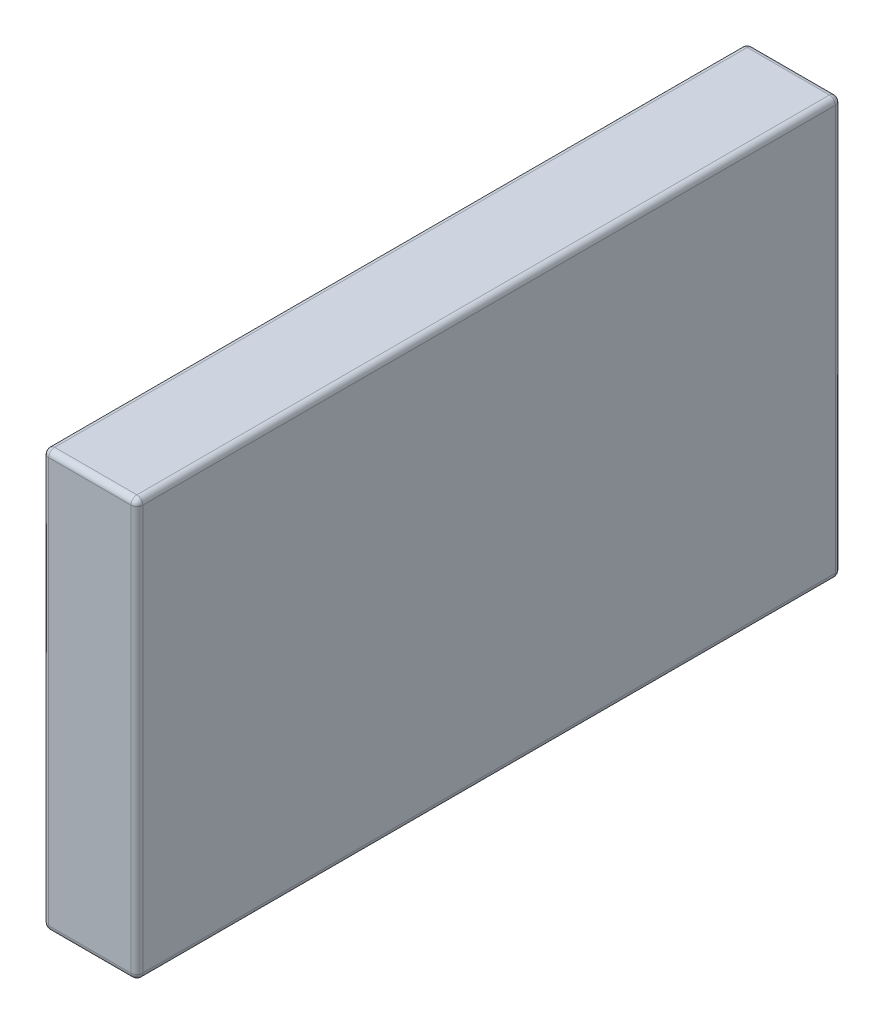
ISO-10303-21;
HEADER;
FILE_DESCRIPTION(('STEP AP214'),'2;1');
FILE_NAME('part.step','',(''),(''),'','','');
FILE_SCHEMA(('AUTOMOTIVE_DESIGN { 1 0 10303 214 1 1 1 1 }'));
ENDSEC;
DATA;
#1=APPLICATION_CONTEXT('core data for automotive mechanical design processes');
#2=APPLICATION_PROTOCOL_DEFINITION('international standard','automotive_design',2000,#1);
#3=PRODUCT_CONTEXT('',#1,'mechanical');
#4=PRODUCT('Part','Part','',(#3));
#5=PRODUCT_RELATED_PRODUCT_CATEGORY('part','',(#4));
#6=PRODUCT_DEFINITION_FORMATION('','',#4);
#7=PRODUCT_DEFINITION_CONTEXT('part definition',#1,'design');
#8=PRODUCT_DEFINITION('design','',#6,#7);
#9=PRODUCT_DEFINITION_SHAPE('','',#8);
#10=(LENGTH_UNIT() NAMED_UNIT(*) SI_UNIT(.MILLI.,.METRE.));
#11=(NAMED_UNIT(*) PLANE_ANGLE_UNIT() SI_UNIT($,.RADIAN.));
#12=(NAMED_UNIT(*) SI_UNIT($,.STERADIAN.) SOLID_ANGLE_UNIT());
#13=UNCERTAINTY_MEASURE_WITH_UNIT(LENGTH_MEASURE(1.E-05),#10,'distance_accuracy_value','');
#14=(GEOMETRIC_REPRESENTATION_CONTEXT(3) GLOBAL_UNCERTAINTY_ASSIGNED_CONTEXT((#13)) GLOBAL_UNIT_ASSIGNED_CONTEXT((#10,
#11,#12)) REPRESENTATION_CONTEXT('',''));
#15=CARTESIAN_POINT('',(0.,0.,0.));
#16=DIRECTION('',(0.,0.,1.));
#17=DIRECTION('',(1.,0.,0.));
#18=AXIS2_PLACEMENT_3D('',#15,#16,#17);
#19=CARTESIAN_POINT('',(-10.033,44.45,75.057));
#20=DIRECTION('',(1.,0.,0.));
#21=DIRECTION('',(0.,0.,-1.));
#22=AXIS2_PLACEMENT_3D('',#19,#20,#21);
#23=PLANE('',#22);
#24=DIRECTION('',(0.,0.,1.));
#25=VECTOR('',#24,1.);
#26=CARTESIAN_POINT('',(-10.033,43.18,-75.057));
#27=LINE('',#26,#25);
#28=CARTESIAN_POINT('',(-10.033,43.18,73.787));
#29=VERTEX_POINT('',#28);
#30=CARTESIAN_POINT('',(-10.033,43.18,-73.787));
#31=VERTEX_POINT('',#30);
#32=EDGE_CURVE('E173',#29,#31,#27,.F.);
#33=ORIENTED_EDGE('',*,*,#32,.T.);
#34=DIRECTION('',(0.,-1.,0.));
#35=VECTOR('',#34,1.);
#36=CARTESIAN_POINT('',(-10.033,44.45,-73.787));
#37=LINE('',#36,#35);
#38=CARTESIAN_POINT('',(-10.033,-43.18,-73.787));
#39=VERTEX_POINT('',#38);
#40=EDGE_CURVE('E179',#31,#39,#37,.T.);
#41=ORIENTED_EDGE('',*,*,#40,.T.);
#42=DIRECTION('',(0.,0.,1.));
#43=VECTOR('',#42,1.);
#44=CARTESIAN_POINT('',(-10.033,-43.18,75.057));
#45=LINE('',#44,#43);
#46=CARTESIAN_POINT('',(-10.033,-43.18,73.787));
#47=VERTEX_POINT('',#46);
#48=EDGE_CURVE('E177',#39,#47,#45,.T.);
#49=ORIENTED_EDGE('',*,*,#48,.T.);
#50=DIRECTION('',(0.,-1.,0.));
#51=VECTOR('',#50,1.);
#52=CARTESIAN_POINT('',(-10.033,44.45,73.787));
#53=LINE('',#52,#51);
#54=EDGE_CURVE('E175',#47,#29,#53,.F.);
#55=ORIENTED_EDGE('',*,*,#54,.T.);
#56=EDGE_LOOP('',(#33,#41,#49,#55));
#57=FACE_BOUND('',#56,.T.);
#58=ADVANCED_FACE('F33',(#57),#23,.F.);
#59=CARTESIAN_POINT('',(10.033,44.45,75.057));
#60=DIRECTION('',(0.,0.,-1.));
#61=DIRECTION('',(-1.,0.,0.));
#62=AXIS2_PLACEMENT_3D('',#59,#60,#61);
#63=PLANE('',#62);
#64=DIRECTION('',(1.,0.,0.));
#65=VECTOR('',#64,1.);
#66=CARTESIAN_POINT('',(-10.033,43.18,75.057));
#67=LINE('',#66,#65);
#68=CARTESIAN_POINT('',(8.76299999999999,43.18,75.057));
#69=VERTEX_POINT('',#68);
#70=CARTESIAN_POINT('',(-8.76300000000001,43.18,75.057));
#71=VERTEX_POINT('',#70);
#72=EDGE_CURVE('E184',#69,#71,#67,.F.);
#73=ORIENTED_EDGE('',*,*,#72,.T.);
#74=DIRECTION('',(0.,-1.,0.));
#75=VECTOR('',#74,1.);
#76=CARTESIAN_POINT('',(-8.76300000000001,44.45,75.057));
#77=LINE('',#76,#75);
#78=CARTESIAN_POINT('',(-8.76300000000001,-43.18,75.057));
#79=VERTEX_POINT('',#78);
#80=EDGE_CURVE('E188',#71,#79,#77,.T.);
#81=ORIENTED_EDGE('',*,*,#80,.T.);
#82=DIRECTION('',(1.,0.,0.));
#83=VECTOR('',#82,1.);
#84=CARTESIAN_POINT('',(10.033,-43.18,75.057));
#85=LINE('',#84,#83);
#86=CARTESIAN_POINT('',(8.76299999999999,-43.18,75.057));
#87=VERTEX_POINT('',#86);
#88=EDGE_CURVE('E186',#79,#87,#85,.T.);
#89=ORIENTED_EDGE('',*,*,#88,.T.);
#90=DIRECTION('',(0.,-1.,0.));
#91=VECTOR('',#90,1.);
#92=CARTESIAN_POINT('',(8.76299999999999,44.45,75.057));
#93=LINE('',#92,#91);
#94=EDGE_CURVE('E182',#87,#69,#93,.F.);
#95=ORIENTED_EDGE('',*,*,#94,.T.);
#96=EDGE_LOOP('',(#73,#81,#89,#95));
#97=FACE_BOUND('',#96,.T.);
#98=ADVANCED_FACE('F272',(#97),#63,.F.);
#99=CARTESIAN_POINT('',(10.033,44.45,75.057));
#100=DIRECTION('',(-1.,0.,0.));
#101=DIRECTION('',(0.,0.,1.));
#102=AXIS2_PLACEMENT_3D('',#99,#100,#101);
#103=PLANE('',#102);
#104=DIRECTION('',(0.,0.,-1.));
#105=VECTOR('',#104,1.);
#106=CARTESIAN_POINT('',(10.033,43.18,75.057));
#107=LINE('',#106,#105);
#108=CARTESIAN_POINT('',(10.033,43.18,-73.787));
#109=VERTEX_POINT('',#108);
#110=CARTESIAN_POINT('',(10.033,43.18,73.787));
#111=VERTEX_POINT('',#110);
#112=EDGE_CURVE('E42',#109,#111,#107,.F.);
#113=ORIENTED_EDGE('',*,*,#112,.T.);
#114=DIRECTION('',(0.,-1.,0.));
#115=VECTOR('',#114,1.);
#116=CARTESIAN_POINT('',(10.033,44.45,73.787));
#117=LINE('',#116,#115);
#118=CARTESIAN_POINT('',(10.033,-43.18,73.787));
#119=VERTEX_POINT('',#118);
#120=EDGE_CURVE('E11',#111,#119,#117,.T.);
#121=ORIENTED_EDGE('',*,*,#120,.T.);
#122=DIRECTION('',(0.,0.,-1.));
#123=VECTOR('',#122,1.);
#124=CARTESIAN_POINT('',(10.033,-43.18,75.057));
#125=LINE('',#124,#123);
#126=CARTESIAN_POINT('',(10.033,-43.18,-73.787));
#127=VERTEX_POINT('',#126);
#128=EDGE_CURVE('E198',#119,#127,#125,.T.);
#129=ORIENTED_EDGE('',*,*,#128,.T.);
#130=DIRECTION('',(0.,-1.,0.));
#131=VECTOR('',#130,1.);
#132=CARTESIAN_POINT('',(10.033,44.45,-73.787));
#133=LINE('',#132,#131);
#134=EDGE_CURVE('E53',#127,#109,#133,.F.);
#135=ORIENTED_EDGE('',*,*,#134,.T.);
#136=EDGE_LOOP('',(#113,#121,#129,#135));
#137=FACE_BOUND('',#136,.T.);
#138=ADVANCED_FACE('F285',(#137),#103,.F.);
#139=CARTESIAN_POINT('',(10.033,44.45,-75.057));
#140=DIRECTION('',(0.,0.,1.));
#141=DIRECTION('',(1.,0.,0.));
#142=AXIS2_PLACEMENT_3D('',#139,#140,#141);
#143=PLANE('',#142);
#144=DIRECTION('',(0.,-1.,0.));
#145=VECTOR('',#144,1.);
#146=CARTESIAN_POINT('',(8.76299999999999,44.45,-75.057));
#147=LINE('',#146,#145);
#148=CARTESIAN_POINT('',(8.76299999999999,43.18,-75.057));
#149=VERTEX_POINT('',#148);
#150=CARTESIAN_POINT('',(8.76299999999999,-43.18,-75.057));
#151=VERTEX_POINT('',#150);
#152=EDGE_CURVE('E125',#149,#151,#147,.T.);
#153=ORIENTED_EDGE('',*,*,#152,.T.);
#154=DIRECTION('',(-1.,0.,0.));
#155=VECTOR('',#154,1.);
#156=CARTESIAN_POINT('',(10.033,-43.18,-75.057));
#157=LINE('',#156,#155);
#158=CARTESIAN_POINT('',(-8.76300000000001,-43.18,-75.057));
#159=VERTEX_POINT('',#158);
#160=EDGE_CURVE('E162',#151,#159,#157,.T.);
#161=ORIENTED_EDGE('',*,*,#160,.T.);
#162=DIRECTION('',(0.,-1.,0.));
#163=VECTOR('',#162,1.);
#164=CARTESIAN_POINT('',(-8.76300000000001,44.45,-75.057));
#165=LINE('',#164,#163);
#166=CARTESIAN_POINT('',(-8.76300000000001,43.18,-75.057));
#167=VERTEX_POINT('',#166);
#168=EDGE_CURVE('E128',#159,#167,#165,.F.);
#169=ORIENTED_EDGE('',*,*,#168,.T.);
#170=DIRECTION('',(-1.,0.,0.));
#171=VECTOR('',#170,1.);
#172=CARTESIAN_POINT('',(10.033,43.18,-75.057));
#173=LINE('',#172,#171);
#174=EDGE_CURVE('E120',#167,#149,#173,.F.);
#175=ORIENTED_EDGE('',*,*,#174,.T.);
#176=EDGE_LOOP('',(#153,#161,#169,#175));
#177=FACE_BOUND('',#176,.T.);
#178=ADVANCED_FACE('F122',(#177),#143,.F.);
#179=CARTESIAN_POINT('',(0.,44.45,0.));
#180=DIRECTION('',(0.,1.,0.));
#181=DIRECTION('',(0.,0.,1.));
#182=AXIS2_PLACEMENT_3D('',#179,#180,#181);
#183=PLANE('',#182);
#184=DIRECTION('',(-1.,0.,0.));
#185=VECTOR('',#184,1.);
#186=CARTESIAN_POINT('',(-10.033,44.45,-73.787));
#187=LINE('',#186,#185);
#188=CARTESIAN_POINT('',(8.76299999999999,44.45,-73.787));
#189=VERTEX_POINT('',#188);
#190=CARTESIAN_POINT('',(-8.76300000000001,44.45,-73.787));
#191=VERTEX_POINT('',#190);
#192=EDGE_CURVE('E139',#189,#191,#187,.T.);
#193=ORIENTED_EDGE('',*,*,#192,.T.);
#194=DIRECTION('',(0.,0.,1.));
#195=VECTOR('',#194,1.);
#196=CARTESIAN_POINT('',(-8.76300000000001,44.45,75.057));
#197=LINE('',#196,#195);
#198=CARTESIAN_POINT('',(-8.76300000000001,44.45,73.787));
#199=VERTEX_POINT('',#198);
#200=EDGE_CURVE('E196',#191,#199,#197,.T.);
#201=ORIENTED_EDGE('',*,*,#200,.T.);
#202=DIRECTION('',(1.,0.,0.));
#203=VECTOR('',#202,1.);
#204=CARTESIAN_POINT('',(10.033,44.45,73.787));
#205=LINE('',#204,#203);
#206=CARTESIAN_POINT('',(8.76299999999999,44.45,73.787));
#207=VERTEX_POINT('',#206);
#208=EDGE_CURVE('E193',#199,#207,#205,.T.);
#209=ORIENTED_EDGE('',*,*,#208,.T.);
#210=DIRECTION('',(0.,0.,-1.));
#211=VECTOR('',#210,1.);
#212=CARTESIAN_POINT('',(8.76299999999999,44.45,-75.057));
#213=LINE('',#212,#211);
#214=EDGE_CURVE('E191',#207,#189,#213,.T.);
#215=ORIENTED_EDGE('',*,*,#214,.T.);
#216=EDGE_LOOP('',(#193,#201,#209,#215));
#217=FACE_BOUND('',#216,.T.);
#218=ADVANCED_FACE('F477',(#217),#183,.T.);
#219=CARTESIAN_POINT('',(0.,-44.45,0.));
#220=DIRECTION('',(0.,1.,0.));
#221=DIRECTION('',(0.,0.,1.));
#222=AXIS2_PLACEMENT_3D('',#219,#220,#221);
#223=PLANE('',#222);
#224=DIRECTION('',(0.,0.,1.));
#225=VECTOR('',#224,1.);
#226=CARTESIAN_POINT('',(-8.76300000000001,-44.45,0.));
#227=LINE('',#226,#225);
#228=CARTESIAN_POINT('',(-8.76300000000001,-44.45,73.787));
#229=VERTEX_POINT('',#228);
#230=CARTESIAN_POINT('',(-8.76300000000001,-44.45,-73.787));
#231=VERTEX_POINT('',#230);
#232=EDGE_CURVE('E168',#229,#231,#227,.F.);
#233=ORIENTED_EDGE('',*,*,#232,.T.);
#234=DIRECTION('',(-1.,0.,0.));
#235=VECTOR('',#234,1.);
#236=CARTESIAN_POINT('',(-1.02063224257471E-13,-44.45,-73.787));
#237=LINE('',#236,#235);
#238=CARTESIAN_POINT('',(8.76299999999999,-44.45,-73.787));
#239=VERTEX_POINT('',#238);
#240=EDGE_CURVE('E170',#231,#239,#237,.F.);
#241=ORIENTED_EDGE('',*,*,#240,.T.);
#242=DIRECTION('',(0.,0.,-1.));
#243=VECTOR('',#242,1.);
#244=CARTESIAN_POINT('',(8.76299999999999,-44.45,0.));
#245=LINE('',#244,#243);
#246=CARTESIAN_POINT('',(8.76299999999999,-44.45,73.787));
#247=VERTEX_POINT('',#246);
#248=EDGE_CURVE('E164',#239,#247,#245,.F.);
#249=ORIENTED_EDGE('',*,*,#248,.T.);
#250=DIRECTION('',(1.,0.,0.));
#251=VECTOR('',#250,1.);
#252=CARTESIAN_POINT('',(0.,-44.45,73.787));
#253=LINE('',#252,#251);
#254=EDGE_CURVE('E166',#247,#229,#253,.F.);
#255=ORIENTED_EDGE('',*,*,#254,.T.);
#256=EDGE_LOOP('',(#233,#241,#249,#255));
#257=FACE_BOUND('',#256,.T.);
#258=ADVANCED_FACE('F470',(#257),#223,.F.);
#259=CARTESIAN_POINT('',(0.,43.18,73.787));
#260=DIRECTION('',(-1.,0.,0.));
#261=DIRECTION('',(0.,0.,1.));
#262=AXIS2_PLACEMENT_3D('',#259,#260,#261);
#263=CYLINDRICAL_SURFACE('',#262,1.27);
#264=CARTESIAN_POINT('',(8.76299999999999,43.18,73.787));
#265=DIRECTION('',(1.,0.,0.));
#266=DIRECTION('',(0.,0.,-1.));
#267=AXIS2_PLACEMENT_3D('',#264,#265,#266);
#268=CIRCLE('',#267,1.27);
#269=EDGE_CURVE('E37',#207,#69,#268,.T.);
#270=ORIENTED_EDGE('',*,*,#269,.F.);
#271=ORIENTED_EDGE('',*,*,#208,.F.);
#272=CARTESIAN_POINT('',(-8.76300000000001,43.18,73.787));
#273=DIRECTION('',(-1.,0.,0.));
#274=DIRECTION('',(0.,0.,1.));
#275=AXIS2_PLACEMENT_3D('',#272,#273,#274);
#276=CIRCLE('',#275,1.27);
#277=EDGE_CURVE('E159',#71,#199,#276,.T.);
#278=ORIENTED_EDGE('',*,*,#277,.F.);
#279=ORIENTED_EDGE('',*,*,#72,.F.);
#280=EDGE_LOOP('',(#270,#271,#278,#279));
#281=FACE_BOUND('',#280,.T.);
#282=ADVANCED_FACE('F35',(#281),#263,.T.);
#283=CARTESIAN_POINT('',(8.76299999999999,43.18,73.787));
#284=DIRECTION('',(0.,0.,1.));
#285=DIRECTION('',(1.,0.,0.));
#286=AXIS2_PLACEMENT_3D('',#283,#284,#285);
#287=SPHERICAL_SURFACE('',#286,1.27);
#288=CARTESIAN_POINT('',(8.76299999999999,43.18,73.787));
#289=DIRECTION('',(0.,0.,1.));
#290=DIRECTION('',(0.,-1.,0.));
#291=AXIS2_PLACEMENT_3D('',#288,#289,#290);
#292=CIRCLE('',#291,1.27);
#293=EDGE_CURVE('E243',#207,#111,#292,.F.);
#294=ORIENTED_EDGE('',*,*,#293,.F.);
#295=ORIENTED_EDGE('',*,*,#269,.T.);
#296=CARTESIAN_POINT('',(8.76299999999999,43.18,73.787));
#297=DIRECTION('',(0.,1.,0.));
#298=DIRECTION('',(0.,0.,1.));
#299=AXIS2_PLACEMENT_3D('',#296,#297,#298);
#300=CIRCLE('',#299,1.27);
#301=EDGE_CURVE('E245',#111,#69,#300,.F.);
#302=ORIENTED_EDGE('',*,*,#301,.F.);
#303=EDGE_LOOP('',(#294,#295,#302));
#304=FACE_BOUND('',#303,.T.);
#305=ADVANCED_FACE('F278',(#304),#287,.T.);
#306=CARTESIAN_POINT('',(-8.76300000000001,43.18,73.787));
#307=DIRECTION('',(0.,0.,1.));
#308=DIRECTION('',(1.,0.,0.));
#309=AXIS2_PLACEMENT_3D('',#306,#307,#308);
#310=SPHERICAL_SURFACE('',#309,1.27);
#311=CARTESIAN_POINT('',(-8.76300000000001,43.18,73.787));
#312=DIRECTION('',(0.,1.,0.));
#313=DIRECTION('',(0.,0.,1.));
#314=AXIS2_PLACEMENT_3D('',#311,#312,#313);
#315=CIRCLE('',#314,1.27);
#316=EDGE_CURVE('E237',#71,#29,#315,.F.);
#317=ORIENTED_EDGE('',*,*,#316,.F.);
#318=ORIENTED_EDGE('',*,*,#277,.T.);
#319=CARTESIAN_POINT('',(-8.76300000000001,43.18,73.787));
#320=DIRECTION('',(0.,0.,1.));
#321=DIRECTION('',(1.,0.,0.));
#322=AXIS2_PLACEMENT_3D('',#319,#320,#321);
#323=CIRCLE('',#322,1.27);
#324=EDGE_CURVE('E240',#29,#199,#323,.F.);
#325=ORIENTED_EDGE('',*,*,#324,.F.);
#326=EDGE_LOOP('',(#317,#318,#325));
#327=FACE_BOUND('',#326,.T.);
#328=ADVANCED_FACE('F252',(#327),#310,.T.);
#329=CARTESIAN_POINT('',(8.76299999999999,44.45,73.787));
#330=DIRECTION('',(0.,-1.,0.));
#331=DIRECTION('',(0.,0.,-1.));
#332=AXIS2_PLACEMENT_3D('',#329,#330,#331);
#333=CYLINDRICAL_SURFACE('',#332,1.27);
#334=ORIENTED_EDGE('',*,*,#301,.T.);
#335=ORIENTED_EDGE('',*,*,#94,.F.);
#336=CARTESIAN_POINT('',(8.76299999999999,-43.18,73.787));
#337=DIRECTION('',(0.,-1.,0.));
#338=DIRECTION('',(0.,0.,-1.));
#339=AXIS2_PLACEMENT_3D('',#336,#337,#338);
#340=CIRCLE('',#339,1.27);
#341=EDGE_CURVE('E231',#119,#87,#340,.T.);
#342=ORIENTED_EDGE('',*,*,#341,.F.);
#343=ORIENTED_EDGE('',*,*,#120,.F.);
#344=EDGE_LOOP('',(#334,#335,#342,#343));
#345=FACE_BOUND('',#344,.T.);
#346=ADVANCED_FACE('F282',(#345),#333,.T.);
#347=CARTESIAN_POINT('',(8.76299999999999,43.18,0.));
#348=DIRECTION('',(0.,0.,1.));
#349=DIRECTION('',(1.,0.,0.));
#350=AXIS2_PLACEMENT_3D('',#347,#348,#349);
#351=CYLINDRICAL_SURFACE('',#350,1.27);
#352=ORIENTED_EDGE('',*,*,#293,.T.);
#353=ORIENTED_EDGE('',*,*,#112,.F.);
#354=CARTESIAN_POINT('',(8.76299999999999,43.18,-73.787));
#355=DIRECTION('',(0.,0.,-1.));
#356=DIRECTION('',(-1.,0.,0.));
#357=AXIS2_PLACEMENT_3D('',#354,#355,#356);
#358=CIRCLE('',#357,1.27);
#359=EDGE_CURVE('E143',#189,#109,#358,.T.);
#360=ORIENTED_EDGE('',*,*,#359,.F.);
#361=ORIENTED_EDGE('',*,*,#214,.F.);
#362=EDGE_LOOP('',(#352,#353,#360,#361));
#363=FACE_BOUND('',#362,.T.);
#364=ADVANCED_FACE('F434',(#363),#351,.T.);
#365=CARTESIAN_POINT('',(-1.02063224257471E-13,43.18,-73.787));
#366=DIRECTION('',(1.,0.,0.));
#367=DIRECTION('',(0.,0.,-1.));
#368=AXIS2_PLACEMENT_3D('',#365,#366,#367);
#369=CYLINDRICAL_SURFACE('',#368,1.27);
#370=CARTESIAN_POINT('',(-8.76300000000001,43.18,-73.787));
#371=DIRECTION('',(-1.,0.,0.));
#372=DIRECTION('',(0.,0.,1.));
#373=AXIS2_PLACEMENT_3D('',#370,#371,#372);
#374=CIRCLE('',#373,1.27);
#375=EDGE_CURVE('E144',#191,#167,#374,.T.);
#376=ORIENTED_EDGE('',*,*,#375,.F.);
#377=ORIENTED_EDGE('',*,*,#192,.F.);
#378=CARTESIAN_POINT('',(8.76299999999999,43.18,-73.787));
#379=DIRECTION('',(1.,0.,0.));
#380=DIRECTION('',(0.,0.,-1.));
#381=AXIS2_PLACEMENT_3D('',#378,#379,#380);
#382=CIRCLE('',#381,1.27);
#383=EDGE_CURVE('E135',#149,#189,#382,.T.);
#384=ORIENTED_EDGE('',*,*,#383,.F.);
#385=ORIENTED_EDGE('',*,*,#174,.F.);
#386=EDGE_LOOP('',(#376,#377,#384,#385));
#387=FACE_BOUND('',#386,.T.);
#388=ADVANCED_FACE('F137',(#387),#369,.T.);
#389=CARTESIAN_POINT('',(-8.76300000000001,43.18,0.));
#390=DIRECTION('',(0.,0.,-1.));
#391=DIRECTION('',(-1.,0.,0.));
#392=AXIS2_PLACEMENT_3D('',#389,#390,#391);
#393=CYLINDRICAL_SURFACE('',#392,1.27);
#394=ORIENTED_EDGE('',*,*,#324,.T.);
#395=ORIENTED_EDGE('',*,*,#200,.F.);
#396=CARTESIAN_POINT('',(-8.76300000000001,43.18,-73.787));
#397=DIRECTION('',(0.,0.,-1.));
#398=DIRECTION('',(0.,1.,0.));
#399=AXIS2_PLACEMENT_3D('',#396,#397,#398);
#400=CIRCLE('',#399,1.27);
#401=EDGE_CURVE('E227',#31,#191,#400,.T.);
#402=ORIENTED_EDGE('',*,*,#401,.F.);
#403=ORIENTED_EDGE('',*,*,#32,.F.);
#404=EDGE_LOOP('',(#394,#395,#402,#403));
#405=FACE_BOUND('',#404,.T.);
#406=ADVANCED_FACE('F260',(#405),#393,.T.);
#407=CARTESIAN_POINT('',(-8.76300000000001,44.45,73.787));
#408=DIRECTION('',(0.,-1.,0.));
#409=DIRECTION('',(0.,0.,-1.));
#410=AXIS2_PLACEMENT_3D('',#407,#408,#409);
#411=CYLINDRICAL_SURFACE('',#410,1.27);
#412=ORIENTED_EDGE('',*,*,#316,.T.);
#413=ORIENTED_EDGE('',*,*,#54,.F.);
#414=CARTESIAN_POINT('',(-8.76300000000001,-43.18,73.787));
#415=DIRECTION('',(0.,-1.,0.));
#416=DIRECTION('',(0.,0.,-1.));
#417=AXIS2_PLACEMENT_3D('',#414,#415,#416);
#418=CIRCLE('',#417,1.27);
#419=EDGE_CURVE('E224',#79,#47,#418,.T.);
#420=ORIENTED_EDGE('',*,*,#419,.F.);
#421=ORIENTED_EDGE('',*,*,#80,.F.);
#422=EDGE_LOOP('',(#412,#413,#420,#421));
#423=FACE_BOUND('',#422,.T.);
#424=ADVANCED_FACE('F269',(#423),#411,.T.);
#425=CARTESIAN_POINT('',(10.033,-43.18,73.787));
#426=DIRECTION('',(1.,0.,0.));
#427=DIRECTION('',(0.,0.,-1.));
#428=AXIS2_PLACEMENT_3D('',#425,#426,#427);
#429=CYLINDRICAL_SURFACE('',#428,1.27);
#430=CARTESIAN_POINT('',(8.76299999999999,-43.18,73.787));
#431=DIRECTION('',(1.,0.,0.));
#432=DIRECTION('',(0.,0.,-1.));
#433=AXIS2_PLACEMENT_3D('',#430,#431,#432);
#434=CIRCLE('',#433,1.27);
#435=EDGE_CURVE('E234',#87,#247,#434,.T.);
#436=ORIENTED_EDGE('',*,*,#435,.F.);
#437=ORIENTED_EDGE('',*,*,#88,.F.);
#438=CARTESIAN_POINT('',(-8.76300000000001,-43.18,73.787));
#439=DIRECTION('',(-1.,0.,0.));
#440=DIRECTION('',(0.,0.,1.));
#441=AXIS2_PLACEMENT_3D('',#438,#439,#440);
#442=CIRCLE('',#441,1.27);
#443=EDGE_CURVE('E222',#229,#79,#442,.T.);
#444=ORIENTED_EDGE('',*,*,#443,.F.);
#445=ORIENTED_EDGE('',*,*,#254,.F.);
#446=EDGE_LOOP('',(#436,#437,#444,#445));
#447=FACE_BOUND('',#446,.T.);
#448=ADVANCED_FACE('F403',(#447),#429,.T.);
#449=CARTESIAN_POINT('',(8.76299999999999,-43.18,73.787));
#450=DIRECTION('',(0.,0.,1.));
#451=DIRECTION('',(1.,0.,0.));
#452=AXIS2_PLACEMENT_3D('',#449,#450,#451);
#453=SPHERICAL_SURFACE('',#452,1.27);
#454=ORIENTED_EDGE('',*,*,#341,.T.);
#455=ORIENTED_EDGE('',*,*,#435,.T.);
#456=CARTESIAN_POINT('',(8.76299999999999,-43.18,73.787));
#457=DIRECTION('',(0.,0.,1.));
#458=DIRECTION('',(1.,0.,0.));
#459=AXIS2_PLACEMENT_3D('',#456,#457,#458);
#460=CIRCLE('',#459,1.27);
#461=EDGE_CURVE('E150',#119,#247,#460,.F.);
#462=ORIENTED_EDGE('',*,*,#461,.F.);
#463=EDGE_LOOP('',(#454,#455,#462));
#464=FACE_BOUND('',#463,.T.);
#465=ADVANCED_FACE('F315',(#464),#453,.T.);
#466=CARTESIAN_POINT('',(8.76299999999999,43.18,-73.787));
#467=DIRECTION('',(0.,0.,1.));
#468=DIRECTION('',(1.,0.,0.));
#469=AXIS2_PLACEMENT_3D('',#466,#467,#468);
#470=SPHERICAL_SURFACE('',#469,1.27);
#471=ORIENTED_EDGE('',*,*,#383,.T.);
#472=ORIENTED_EDGE('',*,*,#359,.T.);
#473=CARTESIAN_POINT('',(8.76299999999999,43.18,-73.787));
#474=DIRECTION('',(0.,1.,0.));
#475=DIRECTION('',(0.,0.,1.));
#476=AXIS2_PLACEMENT_3D('',#473,#474,#475);
#477=CIRCLE('',#476,1.27);
#478=EDGE_CURVE('E147',#149,#109,#477,.F.);
#479=ORIENTED_EDGE('',*,*,#478,.F.);
#480=EDGE_LOOP('',(#471,#472,#479));
#481=FACE_BOUND('',#480,.T.);
#482=ADVANCED_FACE('F148',(#481),#470,.T.);
#483=CARTESIAN_POINT('',(-8.76300000000001,43.18,-73.787));
#484=DIRECTION('',(0.,0.,1.));
#485=DIRECTION('',(1.,0.,0.));
#486=AXIS2_PLACEMENT_3D('',#483,#484,#485);
#487=SPHERICAL_SURFACE('',#486,1.27);
#488=ORIENTED_EDGE('',*,*,#401,.T.);
#489=ORIENTED_EDGE('',*,*,#375,.T.);
#490=CARTESIAN_POINT('',(-8.76300000000001,43.18,-73.787));
#491=DIRECTION('',(0.,1.,0.));
#492=DIRECTION('',(0.,0.,1.));
#493=AXIS2_PLACEMENT_3D('',#490,#491,#492);
#494=CIRCLE('',#493,1.27);
#495=EDGE_CURVE('E151',#31,#167,#494,.F.);
#496=ORIENTED_EDGE('',*,*,#495,.F.);
#497=EDGE_LOOP('',(#488,#489,#496));
#498=FACE_BOUND('',#497,.T.);
#499=ADVANCED_FACE('F305',(#498),#487,.T.);
#500=CARTESIAN_POINT('',(-8.76300000000001,-43.18,73.787));
#501=DIRECTION('',(0.,0.,1.));
#502=DIRECTION('',(1.,0.,0.));
#503=AXIS2_PLACEMENT_3D('',#500,#501,#502);
#504=SPHERICAL_SURFACE('',#503,1.27);
#505=ORIENTED_EDGE('',*,*,#443,.T.);
#506=ORIENTED_EDGE('',*,*,#419,.T.);
#507=CARTESIAN_POINT('',(-8.76300000000001,-43.18,73.787));
#508=DIRECTION('',(0.,0.,1.));
#509=DIRECTION('',(1.,0.,0.));
#510=AXIS2_PLACEMENT_3D('',#507,#508,#509);
#511=CIRCLE('',#510,1.27);
#512=EDGE_CURVE('E215',#229,#47,#511,.F.);
#513=ORIENTED_EDGE('',*,*,#512,.F.);
#514=EDGE_LOOP('',(#505,#506,#513));
#515=FACE_BOUND('',#514,.T.);
#516=ADVANCED_FACE('F307',(#515),#504,.T.);
#517=CARTESIAN_POINT('',(8.76299999999999,-43.18,75.057));
#518=DIRECTION('',(0.,0.,-1.));
#519=DIRECTION('',(-1.,0.,0.));
#520=AXIS2_PLACEMENT_3D('',#517,#518,#519);
#521=CYLINDRICAL_SURFACE('',#520,1.27);
#522=ORIENTED_EDGE('',*,*,#461,.T.);
#523=ORIENTED_EDGE('',*,*,#248,.F.);
#524=CARTESIAN_POINT('',(8.76299999999999,-43.18,-73.787));
#525=DIRECTION('',(0.,0.,-1.));
#526=DIRECTION('',(-1.,0.,0.));
#527=AXIS2_PLACEMENT_3D('',#524,#525,#526);
#528=CIRCLE('',#527,1.27);
#529=EDGE_CURVE('E212',#127,#239,#528,.T.);
#530=ORIENTED_EDGE('',*,*,#529,.F.);
#531=ORIENTED_EDGE('',*,*,#128,.F.);
#532=EDGE_LOOP('',(#522,#523,#530,#531));
#533=FACE_BOUND('',#532,.T.);
#534=ADVANCED_FACE('F290',(#533),#521,.T.);
#535=CARTESIAN_POINT('',(8.76299999999999,44.45,-73.787));
#536=DIRECTION('',(0.,-1.,0.));
#537=DIRECTION('',(0.,0.,-1.));
#538=AXIS2_PLACEMENT_3D('',#535,#536,#537);
#539=CYLINDRICAL_SURFACE('',#538,1.27);
#540=ORIENTED_EDGE('',*,*,#478,.T.);
#541=ORIENTED_EDGE('',*,*,#134,.F.);
#542=CARTESIAN_POINT('',(8.76299999999999,-43.18,-73.787));
#543=DIRECTION('',(0.,-1.,0.));
#544=DIRECTION('',(0.,0.,-1.));
#545=AXIS2_PLACEMENT_3D('',#542,#543,#544);
#546=CIRCLE('',#545,1.27);
#547=EDGE_CURVE('E155',#151,#127,#546,.T.);
#548=ORIENTED_EDGE('',*,*,#547,.F.);
#549=ORIENTED_EDGE('',*,*,#152,.F.);
#550=EDGE_LOOP('',(#540,#541,#548,#549));
#551=FACE_BOUND('',#550,.T.);
#552=ADVANCED_FACE('F153',(#551),#539,.T.);
#553=CARTESIAN_POINT('',(-8.76300000000001,44.45,-73.787));
#554=DIRECTION('',(0.,-1.,0.));
#555=DIRECTION('',(0.,0.,-1.));
#556=AXIS2_PLACEMENT_3D('',#553,#554,#555);
#557=CYLINDRICAL_SURFACE('',#556,1.27);
#558=ORIENTED_EDGE('',*,*,#495,.T.);
#559=ORIENTED_EDGE('',*,*,#168,.F.);
#560=CARTESIAN_POINT('',(-8.76300000000001,-43.18,-73.787));
#561=DIRECTION('',(0.,-1.,0.));
#562=DIRECTION('',(0.,0.,-1.));
#563=AXIS2_PLACEMENT_3D('',#560,#561,#562);
#564=CIRCLE('',#563,1.27);
#565=EDGE_CURVE('E208',#39,#159,#564,.T.);
#566=ORIENTED_EDGE('',*,*,#565,.F.);
#567=ORIENTED_EDGE('',*,*,#40,.F.);
#568=EDGE_LOOP('',(#558,#559,#566,#567));
#569=FACE_BOUND('',#568,.T.);
#570=ADVANCED_FACE('F303',(#569),#557,.T.);
#571=CARTESIAN_POINT('',(-8.76300000000001,-43.18,75.057));
#572=DIRECTION('',(0.,0.,1.));
#573=DIRECTION('',(1.,0.,0.));
#574=AXIS2_PLACEMENT_3D('',#571,#572,#573);
#575=CYLINDRICAL_SURFACE('',#574,1.27);
#576=ORIENTED_EDGE('',*,*,#512,.T.);
#577=ORIENTED_EDGE('',*,*,#48,.F.);
#578=CARTESIAN_POINT('',(-8.76300000000001,-43.18,-73.787));
#579=DIRECTION('',(0.,0.,-1.));
#580=DIRECTION('',(-1.,0.,0.));
#581=AXIS2_PLACEMENT_3D('',#578,#579,#580);
#582=CIRCLE('',#581,1.27);
#583=EDGE_CURVE('E206',#231,#39,#582,.T.);
#584=ORIENTED_EDGE('',*,*,#583,.F.);
#585=ORIENTED_EDGE('',*,*,#232,.F.);
#586=EDGE_LOOP('',(#576,#577,#584,#585));
#587=FACE_BOUND('',#586,.T.);
#588=ADVANCED_FACE('F331',(#587),#575,.T.);
#589=CARTESIAN_POINT('',(8.76299999999999,-43.18,-73.787));
#590=DIRECTION('',(0.,0.,1.));
#591=DIRECTION('',(1.,0.,0.));
#592=AXIS2_PLACEMENT_3D('',#589,#590,#591);
#593=SPHERICAL_SURFACE('',#592,1.27);
#594=ORIENTED_EDGE('',*,*,#547,.T.);
#595=ORIENTED_EDGE('',*,*,#529,.T.);
#596=CARTESIAN_POINT('',(8.76299999999999,-43.18,-73.787));
#597=DIRECTION('',(1.,0.,0.));
#598=DIRECTION('',(0.,0.,-1.));
#599=AXIS2_PLACEMENT_3D('',#596,#597,#598);
#600=CIRCLE('',#599,1.27);
#601=EDGE_CURVE('E204',#151,#239,#600,.F.);
#602=ORIENTED_EDGE('',*,*,#601,.F.);
#603=EDGE_LOOP('',(#594,#595,#602));
#604=FACE_BOUND('',#603,.T.);
#605=ADVANCED_FACE('F292',(#604),#593,.T.);
#606=CARTESIAN_POINT('',(-8.76300000000001,-43.18,-73.787));
#607=DIRECTION('',(0.,0.,1.));
#608=DIRECTION('',(1.,0.,0.));
#609=AXIS2_PLACEMENT_3D('',#606,#607,#608);
#610=SPHERICAL_SURFACE('',#609,1.27);
#611=ORIENTED_EDGE('',*,*,#583,.T.);
#612=ORIENTED_EDGE('',*,*,#565,.T.);
#613=CARTESIAN_POINT('',(-8.76300000000001,-43.18,-73.787));
#614=DIRECTION('',(-1.,0.,0.));
#615=DIRECTION('',(0.,0.,1.));
#616=AXIS2_PLACEMENT_3D('',#613,#614,#615);
#617=CIRCLE('',#616,1.27);
#618=EDGE_CURVE('E202',#231,#159,#617,.F.);
#619=ORIENTED_EDGE('',*,*,#618,.F.);
#620=EDGE_LOOP('',(#611,#612,#619));
#621=FACE_BOUND('',#620,.T.);
#622=ADVANCED_FACE('F300',(#621),#610,.T.);
#623=CARTESIAN_POINT('',(10.033,-43.18,-73.787));
#624=DIRECTION('',(-1.,0.,0.));
#625=DIRECTION('',(0.,0.,1.));
#626=AXIS2_PLACEMENT_3D('',#623,#624,#625);
#627=CYLINDRICAL_SURFACE('',#626,1.27);
#628=ORIENTED_EDGE('',*,*,#601,.T.);
#629=ORIENTED_EDGE('',*,*,#240,.F.);
#630=ORIENTED_EDGE('',*,*,#618,.T.);
#631=ORIENTED_EDGE('',*,*,#160,.F.);
#632=EDGE_LOOP('',(#628,#629,#630,#631));
#633=FACE_BOUND('',#632,.T.);
#634=ADVANCED_FACE('F296',(#633),#627,.T.);
#635=CLOSED_SHELL('',(#58,#98,#138,#178,#218,#258,#282,#305,#328,#346,#364,#388,#406,#424,#448,
#465,#482,#499,#516,#534,#552,#570,#588,#605,#622,#634));
#636=MANIFOLD_SOLID_BREP('B2',#635);
#637=ADVANCED_BREP_SHAPE_REPRESENTATION('',(#18,#636),#14);
#638=SHAPE_DEFINITION_REPRESENTATION(#9,#637);
ENDSEC;
END-ISO-10303-21;
